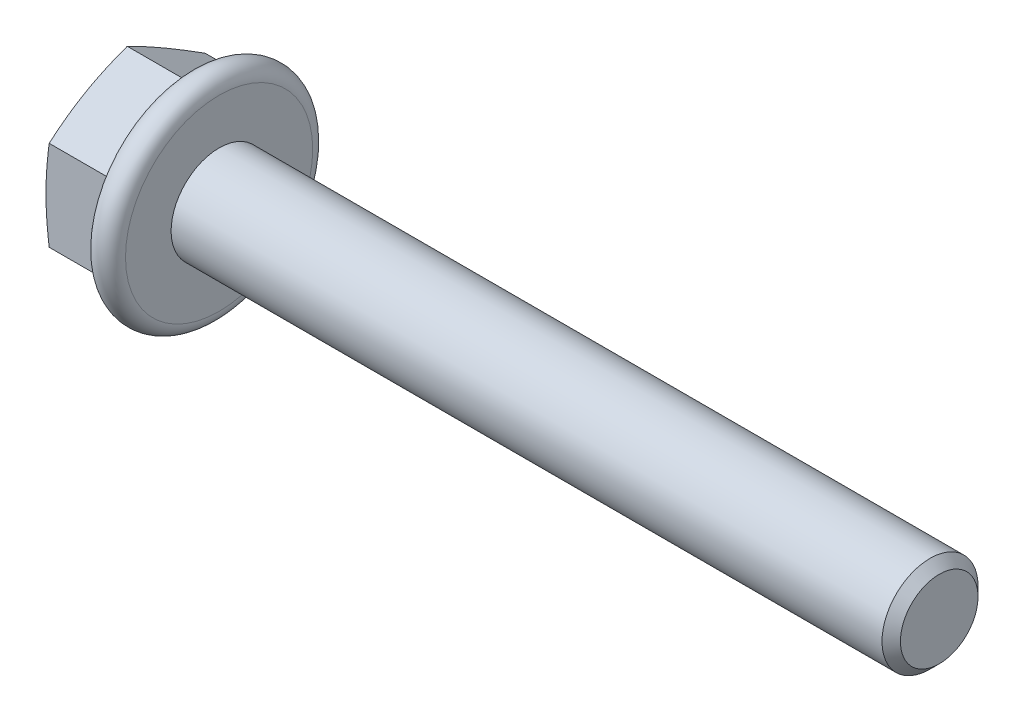
ISO-10303-21;
HEADER;
FILE_DESCRIPTION(('STEP AP214'),'2;1');
FILE_NAME('part.step','',(''),(''),'','','');
FILE_SCHEMA(('AUTOMOTIVE_DESIGN { 1 0 10303 214 1 1 1 1 }'));
ENDSEC;
DATA;
#1=APPLICATION_CONTEXT('core data for automotive mechanical design processes');
#2=APPLICATION_PROTOCOL_DEFINITION('international standard','automotive_design',2000,#1);
#3=PRODUCT_CONTEXT('',#1,'mechanical');
#4=PRODUCT('Part','Part','',(#3));
#5=PRODUCT_RELATED_PRODUCT_CATEGORY('part','',(#4));
#6=PRODUCT_DEFINITION_FORMATION('','',#4);
#7=PRODUCT_DEFINITION_CONTEXT('part definition',#1,'design');
#8=PRODUCT_DEFINITION('design','',#6,#7);
#9=PRODUCT_DEFINITION_SHAPE('','',#8);
#10=(LENGTH_UNIT() NAMED_UNIT(*) SI_UNIT(.MILLI.,.METRE.));
#11=(NAMED_UNIT(*) PLANE_ANGLE_UNIT() SI_UNIT($,.RADIAN.));
#12=(NAMED_UNIT(*) SI_UNIT($,.STERADIAN.) SOLID_ANGLE_UNIT());
#13=UNCERTAINTY_MEASURE_WITH_UNIT(LENGTH_MEASURE(1.E-05),#10,'distance_accuracy_value','');
#14=(GEOMETRIC_REPRESENTATION_CONTEXT(3) GLOBAL_UNCERTAINTY_ASSIGNED_CONTEXT((#13)) GLOBAL_UNIT_ASSIGNED_CONTEXT((#10,
#11,#12)) REPRESENTATION_CONTEXT('',''));
#15=CARTESIAN_POINT('',(0.,0.,0.));
#16=DIRECTION('',(0.,0.,1.));
#17=DIRECTION('',(1.,0.,0.));
#18=AXIS2_PLACEMENT_3D('',#15,#16,#17);
#19=CARTESIAN_POINT('',(0.,5.9,0.));
#20=DIRECTION('',(1.,0.,0.));
#21=DIRECTION('',(0.,1.,0.));
#22=AXIS2_PLACEMENT_3D('',#19,#20,#21);
#23=PLANE('',#22);
#24=CARTESIAN_POINT('',(0.,0.,0.));
#25=DIRECTION('',(1.,0.,0.));
#26=DIRECTION('',(0.,1.,0.));
#27=AXIS2_PLACEMENT_3D('',#24,#25,#26);
#28=CIRCLE('',#27,7.8);
#29=CARTESIAN_POINT('',(0.,7.8,0.));
#30=VERTEX_POINT('',#29);
#31=EDGE_CURVE('E11',#30,#30,#28,.T.);
#32=ORIENTED_EDGE('',*,*,#31,.T.);
#33=EDGE_LOOP('',(#32));
#34=FACE_BOUND('',#33,.T.);
#35=CARTESIAN_POINT('',(0.,0.,0.));
#36=DIRECTION('',(1.,0.,0.));
#37=DIRECTION('',(0.,1.,0.));
#38=AXIS2_PLACEMENT_3D('',#35,#36,#37);
#39=CIRCLE('',#38,4.);
#40=CARTESIAN_POINT('',(0.,4.,0.));
#41=VERTEX_POINT('',#40);
#42=EDGE_CURVE('E242',#41,#41,#39,.T.);
#43=ORIENTED_EDGE('',*,*,#42,.F.);
#44=EDGE_LOOP('',(#43));
#45=FACE_BOUND('',#44,.T.);
#46=ADVANCED_FACE('F16',(#34,#45),#23,.T.);
#47=CARTESIAN_POINT('',(-1.2,0.,0.));
#48=DIRECTION('',(1.,0.,0.));
#49=DIRECTION('',(0.,0.,-1.));
#50=AXIS2_PLACEMENT_3D('',#47,#48,#49);
#51=TOROIDAL_SURFACE('',#50,7.8,1.2);
#52=CARTESIAN_POINT('',(-2.28756934444398,0.,0.));
#53=DIRECTION('',(1.,0.,0.));
#54=DIRECTION('',(0.,1.,0.));
#55=AXIS2_PLACEMENT_3D('',#52,#53,#54);
#56=CIRCLE('',#55,8.30714191408884);
#57=CARTESIAN_POINT('',(-2.28756934444398,8.30714191408884,0.));
#58=VERTEX_POINT('',#57);
#59=EDGE_CURVE('E29',#58,#58,#56,.T.);
#60=ORIENTED_EDGE('',*,*,#59,.T.);
#61=EDGE_LOOP('',(#60));
#62=FACE_BOUND('',#61,.T.);
#63=ORIENTED_EDGE('',*,*,#31,.F.);
#64=EDGE_LOOP('',(#63));
#65=FACE_BOUND('',#64,.T.);
#66=ADVANCED_FACE('F305',(#62,#65),#51,.T.);
#67=CARTESIAN_POINT('',(-2.96628467222199,0.,0.));
#68=DIRECTION('',(1.,0.,0.));
#69=DIRECTION('',(0.,1.,0.));
#70=AXIS2_PLACEMENT_3D('',#67,#68,#69);
#71=CONICAL_SURFACE('',#70,6.85163219661298,1.1344640138);
#72=ORIENTED_EDGE('',*,*,#59,.F.);
#73=EDGE_LOOP('',(#72));
#74=FACE_BOUND('',#73,.T.);
#75=CARTESIAN_POINT('',(-2.66135616087134,3.75277674973256,-6.5));
#76=CARTESIAN_POINT('',(-3.53633042974448,5.62916512459884,-3.25000000000001));
#77=CARTESIAN_POINT('',(-2.66135616087134,7.50555349946513,0.));
#78=(BOUNDED_CURVE() B_SPLINE_CURVE(2,(#75,#76,#77),.UNSPECIFIED.,.F.,
.F.) B_SPLINE_CURVE_WITH_KNOTS((3,3),(0.122119894737377,0.926092360421994),
.UNSPECIFIED.) CURVE() GEOMETRIC_REPRESENTATION_ITEM() RATIONAL_B_SPLINE_CURVE((1.05723361198504,
1.22078822095175,1.05723361198504)) REPRESENTATION_ITEM(''));
#79=CARTESIAN_POINT('',(-2.66135616087134,3.75277674973256,-6.5));
#80=VERTEX_POINT('',#79);
#81=CARTESIAN_POINT('',(-2.66135616087134,7.50555349946513,0.));
#82=VERTEX_POINT('',#81);
#83=EDGE_CURVE('E101',#80,#82,#78,.T.);
#84=ORIENTED_EDGE('',*,*,#83,.T.);
#85=CARTESIAN_POINT('',(-2.66135616087134,7.50555349946513,0.));
#86=CARTESIAN_POINT('',(-3.53633042974448,5.62916512459885,3.24999999999999));
#87=CARTESIAN_POINT('',(-2.66135616087134,3.75277674973257,6.5));
#88=(BOUNDED_CURVE() B_SPLINE_CURVE(2,(#85,#86,#87),.UNSPECIFIED.,.F.,
.F.) B_SPLINE_CURVE_WITH_KNOTS((3,3),(0.122119894737377,0.926092360421993),
.UNSPECIFIED.) CURVE() GEOMETRIC_REPRESENTATION_ITEM() RATIONAL_B_SPLINE_CURVE((1.05723361198504,
1.22078822095176,1.05723361198504)) REPRESENTATION_ITEM(''));
#89=CARTESIAN_POINT('',(-2.66135616087134,3.75277674973257,6.5));
#90=VERTEX_POINT('',#89);
#91=EDGE_CURVE('E172',#82,#90,#88,.T.);
#92=ORIENTED_EDGE('',*,*,#91,.T.);
#93=CARTESIAN_POINT('',(-2.66135616087134,3.75277674973257,6.5));
#94=CARTESIAN_POINT('',(-3.53633042974448,0.,6.5));
#95=CARTESIAN_POINT('',(-2.66135616087134,-3.75277674973257,6.5));
#96=(BOUNDED_CURVE() B_SPLINE_CURVE(2,(#93,#94,#95),.UNSPECIFIED.,.F.,
.F.) B_SPLINE_CURVE_WITH_KNOTS((3,3),(0.122119894737378,0.926092360421994),
.UNSPECIFIED.) CURVE() GEOMETRIC_REPRESENTATION_ITEM() RATIONAL_B_SPLINE_CURVE((1.05723361198504,
1.22078822095175,1.05723361198504)) REPRESENTATION_ITEM(''));
#97=CARTESIAN_POINT('',(-2.66135616087134,-3.75277674973257,6.5));
#98=VERTEX_POINT('',#97);
#99=EDGE_CURVE('E160',#90,#98,#96,.T.);
#100=ORIENTED_EDGE('',*,*,#99,.T.);
#101=CARTESIAN_POINT('',(-2.66135616087134,-3.75277674973257,6.5));
#102=CARTESIAN_POINT('',(-3.53633042974448,-5.62916512459885,3.25000000000001));
#103=CARTESIAN_POINT('',(-2.66135616087134,-7.50555349946514,0.));
#104=(BOUNDED_CURVE() B_SPLINE_CURVE(2,(#101,#102,#103),.UNSPECIFIED.,.F.,
.F.) B_SPLINE_CURVE_WITH_KNOTS((3,3),(0.122119894737378,0.926092360421993),
.UNSPECIFIED.) CURVE() GEOMETRIC_REPRESENTATION_ITEM() RATIONAL_B_SPLINE_CURVE((1.05723361198504,
1.22078822095175,1.05723361198504)) REPRESENTATION_ITEM(''));
#105=CARTESIAN_POINT('',(-2.66135616087133,-7.50555349946514,0.));
#106=VERTEX_POINT('',#105);
#107=EDGE_CURVE('E186',#98,#106,#104,.T.);
#108=ORIENTED_EDGE('',*,*,#107,.T.);
#109=CARTESIAN_POINT('',(-2.66135616087133,-7.50555349946514,0.));
#110=CARTESIAN_POINT('',(-3.53633042974447,-5.62916512459886,-3.24999999999999));
#111=CARTESIAN_POINT('',(-2.66135616087134,-3.75277674973257,-6.5));
#112=(BOUNDED_CURVE() B_SPLINE_CURVE(2,(#109,#110,#111),.UNSPECIFIED.,.F.,
.F.) B_SPLINE_CURVE_WITH_KNOTS((3,3),(0.122119894737377,0.926092360421993),
.UNSPECIFIED.) CURVE() GEOMETRIC_REPRESENTATION_ITEM() RATIONAL_B_SPLINE_CURVE((1.05723361198504,
1.22078822095175,1.05723361198504)) REPRESENTATION_ITEM(''));
#113=CARTESIAN_POINT('',(-2.66135616087134,-3.75277674973257,-6.5));
#114=VERTEX_POINT('',#113);
#115=EDGE_CURVE('E118',#106,#114,#112,.T.);
#116=ORIENTED_EDGE('',*,*,#115,.T.);
#117=CARTESIAN_POINT('',(-2.66135616087134,-3.75277674973257,-6.5));
#118=CARTESIAN_POINT('',(-3.53633042974447,0.,-6.5));
#119=CARTESIAN_POINT('',(-2.66135616087134,3.75277674973256,-6.5));
#120=(BOUNDED_CURVE() B_SPLINE_CURVE(2,(#117,#118,#119),.UNSPECIFIED.,.F.,
.F.) B_SPLINE_CURVE_WITH_KNOTS((3,3),(0.122119894737377,0.926092360421993),
.UNSPECIFIED.) CURVE() GEOMETRIC_REPRESENTATION_ITEM() RATIONAL_B_SPLINE_CURVE((1.05723361198504,
1.22078822095175,1.05723361198504)) REPRESENTATION_ITEM(''));
#121=EDGE_CURVE('E115',#114,#80,#120,.T.);
#122=ORIENTED_EDGE('',*,*,#121,.T.);
#123=EDGE_LOOP('',(#84,#92,#100,#108,#116,#122));
#124=FACE_BOUND('',#123,.T.);
#125=ADVANCED_FACE('F116',(#74,#124),#71,.T.);
#126=CARTESIAN_POINT('',(-8.1,0.,0.));
#127=DIRECTION('',(1.,0.,0.));
#128=DIRECTION('',(0.,1.,0.));
#129=AXIS2_PLACEMENT_3D('',#126,#127,#128);
#130=PLANE('',#129);
#131=CARTESIAN_POINT('',(-8.1,0.,0.));
#132=DIRECTION('',(-1.,0.,0.));
#133=DIRECTION('',(0.,1.,0.));
#134=AXIS2_PLACEMENT_3D('',#131,#132,#133);
#135=CIRCLE('',#134,5.85);
#136=CARTESIAN_POINT('',(-8.1,5.85,0.));
#137=VERTEX_POINT('',#136);
#138=EDGE_CURVE('E94',#137,#137,#135,.T.);
#139=ORIENTED_EDGE('',*,*,#138,.T.);
#140=EDGE_LOOP('',(#139));
#141=FACE_BOUND('',#140,.T.);
#142=ADVANCED_FACE('F18',(#141),#130,.F.);
#143=CARTESIAN_POINT('',(0.,-7.50555349946514,0.));
#144=DIRECTION('',(0.,-0.866025403784439,-0.5));
#145=DIRECTION('',(0.,0.5,-0.866025403784439));
#146=AXIS2_PLACEMENT_3D('',#143,#144,#145);
#147=PLANE('',#146);
#148=CARTESIAN_POINT('',(-7.6563957767918,-7.50555349946513,0.));
#149=CARTESIAN_POINT('',(-8.15917252652436,-5.62916512459886,-3.25));
#150=CARTESIAN_POINT('',(-7.6563957767918,-3.75277674973258,-6.5));
#151=(BOUNDED_CURVE() B_SPLINE_CURVE(2,(#148,#149,#150),.UNSPECIFIED.,.F.,
.F.) B_SPLINE_CURVE_WITH_KNOTS((3,3),(0.,0.75248733581402),
.UNSPECIFIED.) CURVE() GEOMETRIC_REPRESENTATION_ITEM() RATIONAL_B_SPLINE_CURVE((1.,
1.15470053837925,1.)) REPRESENTATION_ITEM(''));
#152=CARTESIAN_POINT('',(-7.6563957767918,-7.50555349946513,0.));
#153=VERTEX_POINT('',#152);
#154=CARTESIAN_POINT('',(-7.6563957767918,-3.75277674973258,-6.5));
#155=VERTEX_POINT('',#154);
#156=EDGE_CURVE('E175',#153,#155,#151,.T.);
#157=ORIENTED_EDGE('',*,*,#156,.T.);
#158=DIRECTION('',(-1.,0.,0.));
#159=VECTOR('',#158,1.);
#160=CARTESIAN_POINT('',(0.,-3.75277674973257,-6.5));
#161=LINE('',#160,#159);
#162=EDGE_CURVE('E123',#114,#155,#161,.T.);
#163=ORIENTED_EDGE('',*,*,#162,.F.);
#164=ORIENTED_EDGE('',*,*,#115,.F.);
#165=DIRECTION('',(-1.,0.,0.));
#166=VECTOR('',#165,1.);
#167=CARTESIAN_POINT('',(0.,-7.50555349946514,0.));
#168=LINE('',#167,#166);
#169=EDGE_CURVE('E139',#106,#153,#168,.T.);
#170=ORIENTED_EDGE('',*,*,#169,.T.);
#171=EDGE_LOOP('',(#157,#163,#164,#170));
#172=FACE_BOUND('',#171,.T.);
#173=ADVANCED_FACE('F291',(#172),#147,.T.);
#174=CARTESIAN_POINT('',(0.,-3.75277674973257,6.5));
#175=DIRECTION('',(0.,-0.866025403784438,0.5));
#176=DIRECTION('',(-1.,0.,0.));
#177=AXIS2_PLACEMENT_3D('',#174,#175,#176);
#178=PLANE('',#177);
#179=CARTESIAN_POINT('',(-7.6563957767918,-3.75277674973257,6.5));
#180=CARTESIAN_POINT('',(-8.15917252652436,-5.62916512459886,3.25));
#181=CARTESIAN_POINT('',(-7.6563957767918,-7.50555349946513,0.));
#182=(BOUNDED_CURVE() B_SPLINE_CURVE(2,(#179,#180,#181),.UNSPECIFIED.,.F.,
.F.) B_SPLINE_CURVE_WITH_KNOTS((3,3),(0.,0.75248733581402),
.UNSPECIFIED.) CURVE() GEOMETRIC_REPRESENTATION_ITEM() RATIONAL_B_SPLINE_CURVE((1.,
1.15470053837925,1.)) REPRESENTATION_ITEM(''));
#183=CARTESIAN_POINT('',(-7.6563957767918,-3.75277674973256,6.5));
#184=VERTEX_POINT('',#183);
#185=EDGE_CURVE('E135',#184,#153,#182,.T.);
#186=ORIENTED_EDGE('',*,*,#185,.T.);
#187=ORIENTED_EDGE('',*,*,#169,.F.);
#188=ORIENTED_EDGE('',*,*,#107,.F.);
#189=DIRECTION('',(-1.,0.,0.));
#190=VECTOR('',#189,1.);
#191=CARTESIAN_POINT('',(0.,-3.75277674973257,6.5));
#192=LINE('',#191,#190);
#193=EDGE_CURVE('E166',#98,#184,#192,.T.);
#194=ORIENTED_EDGE('',*,*,#193,.T.);
#195=EDGE_LOOP('',(#186,#187,#188,#194));
#196=FACE_BOUND('',#195,.T.);
#197=ADVANCED_FACE('F285',(#196),#178,.T.);
#198=CARTESIAN_POINT('',(0.,3.75277674973257,6.5));
#199=DIRECTION('',(0.,0.,1.));
#200=DIRECTION('',(0.,-1.,0.));
#201=AXIS2_PLACEMENT_3D('',#198,#199,#200);
#202=PLANE('',#201);
#203=CARTESIAN_POINT('',(-7.6563957767918,3.75277674973257,6.5));
#204=CARTESIAN_POINT('',(-8.15917252652437,0.,6.50000000000001));
#205=CARTESIAN_POINT('',(-7.6563957767918,-3.75277674973257,6.5));
#206=(BOUNDED_CURVE() B_SPLINE_CURVE(2,(#203,#204,#205),.UNSPECIFIED.,.F.,
.F.) B_SPLINE_CURVE_WITH_KNOTS((3,3),(0.,0.752487335814022),
.UNSPECIFIED.) CURVE() GEOMETRIC_REPRESENTATION_ITEM() RATIONAL_B_SPLINE_CURVE((1.,
1.15470053837925,1.)) REPRESENTATION_ITEM(''));
#207=CARTESIAN_POINT('',(-7.6563957767918,3.75277674973256,6.5));
#208=VERTEX_POINT('',#207);
#209=EDGE_CURVE('E20',#208,#184,#206,.T.);
#210=ORIENTED_EDGE('',*,*,#209,.T.);
#211=ORIENTED_EDGE('',*,*,#193,.F.);
#212=ORIENTED_EDGE('',*,*,#99,.F.);
#213=DIRECTION('',(-1.,0.,0.));
#214=VECTOR('',#213,1.);
#215=CARTESIAN_POINT('',(0.,3.75277674973257,6.5));
#216=LINE('',#215,#214);
#217=EDGE_CURVE('E112',#90,#208,#216,.T.);
#218=ORIENTED_EDGE('',*,*,#217,.T.);
#219=EDGE_LOOP('',(#210,#211,#212,#218));
#220=FACE_BOUND('',#219,.T.);
#221=ADVANCED_FACE('F320',(#220),#202,.T.);
#222=CARTESIAN_POINT('',(0.,7.50555349946513,0.));
#223=DIRECTION('',(0.,0.866025403784439,0.5));
#224=DIRECTION('',(1.,0.,0.));
#225=AXIS2_PLACEMENT_3D('',#222,#223,#224);
#226=PLANE('',#225);
#227=CARTESIAN_POINT('',(-7.6563957767918,7.50555349946513,0.));
#228=CARTESIAN_POINT('',(-8.15917252652436,5.62916512459886,3.25));
#229=CARTESIAN_POINT('',(-7.6563957767918,3.75277674973257,6.5));
#230=(BOUNDED_CURVE() B_SPLINE_CURVE(2,(#227,#228,#229),.UNSPECIFIED.,.F.,
.F.) B_SPLINE_CURVE_WITH_KNOTS((3,3),(0.,0.75248733581402),
.UNSPECIFIED.) CURVE() GEOMETRIC_REPRESENTATION_ITEM() RATIONAL_B_SPLINE_CURVE((1.,
1.15470053837925,1.)) REPRESENTATION_ITEM(''));
#231=CARTESIAN_POINT('',(-7.6563957767918,7.50555349946513,0.));
#232=VERTEX_POINT('',#231);
#233=EDGE_CURVE('E143',#232,#208,#230,.T.);
#234=ORIENTED_EDGE('',*,*,#233,.T.);
#235=ORIENTED_EDGE('',*,*,#217,.F.);
#236=ORIENTED_EDGE('',*,*,#91,.F.);
#237=DIRECTION('',(-1.,0.,0.));
#238=VECTOR('',#237,1.);
#239=CARTESIAN_POINT('',(0.,7.50555349946513,0.));
#240=LINE('',#239,#238);
#241=EDGE_CURVE('E108',#82,#232,#240,.T.);
#242=ORIENTED_EDGE('',*,*,#241,.T.);
#243=EDGE_LOOP('',(#234,#235,#236,#242));
#244=FACE_BOUND('',#243,.T.);
#245=ADVANCED_FACE('F317',(#244),#226,.T.);
#246=CARTESIAN_POINT('',(0.,3.75277674973256,-6.5));
#247=DIRECTION('',(0.,0.866025403784439,-0.5));
#248=DIRECTION('',(-1.,0.,0.));
#249=AXIS2_PLACEMENT_3D('',#246,#247,#248);
#250=PLANE('',#249);
#251=CARTESIAN_POINT('',(-7.6563957767918,3.75277674973256,-6.5));
#252=CARTESIAN_POINT('',(-8.15917252652437,5.62916512459886,-3.25));
#253=CARTESIAN_POINT('',(-7.6563957767918,7.50555349946513,0.));
#254=(BOUNDED_CURVE() B_SPLINE_CURVE(2,(#251,#252,#253),.UNSPECIFIED.,.F.,
.F.) B_SPLINE_CURVE_WITH_KNOTS((3,3),(0.,0.752487335814022),
.UNSPECIFIED.) CURVE() GEOMETRIC_REPRESENTATION_ITEM() RATIONAL_B_SPLINE_CURVE((1.,
1.15470053837925,1.)) REPRESENTATION_ITEM(''));
#255=CARTESIAN_POINT('',(-7.6563957767918,3.75277674973256,-6.5));
#256=VERTEX_POINT('',#255);
#257=EDGE_CURVE('E149',#256,#232,#254,.T.);
#258=ORIENTED_EDGE('',*,*,#257,.T.);
#259=ORIENTED_EDGE('',*,*,#241,.F.);
#260=ORIENTED_EDGE('',*,*,#83,.F.);
#261=DIRECTION('',(-1.,0.,0.));
#262=VECTOR('',#261,1.);
#263=CARTESIAN_POINT('',(0.,3.75277674973256,-6.5));
#264=LINE('',#263,#262);
#265=EDGE_CURVE('E106',#80,#256,#264,.T.);
#266=ORIENTED_EDGE('',*,*,#265,.T.);
#267=EDGE_LOOP('',(#258,#259,#260,#266));
#268=FACE_BOUND('',#267,.T.);
#269=ADVANCED_FACE('F104',(#268),#250,.T.);
#270=CARTESIAN_POINT('',(0.,-3.75277674973257,-6.5));
#271=DIRECTION('',(0.,0.,-1.));
#272=DIRECTION('',(0.,-1.,0.));
#273=AXIS2_PLACEMENT_3D('',#270,#271,#272);
#274=PLANE('',#273);
#275=CARTESIAN_POINT('',(-7.6563957767918,-3.75277674973256,-6.5));
#276=CARTESIAN_POINT('',(-8.15917252652436,0.,-6.50000000000001));
#277=CARTESIAN_POINT('',(-7.6563957767918,3.75277674973256,-6.5));
#278=(BOUNDED_CURVE() B_SPLINE_CURVE(2,(#275,#276,#277),.UNSPECIFIED.,.F.,
.F.) B_SPLINE_CURVE_WITH_KNOTS((3,3),(0.,0.75248733581402),
.UNSPECIFIED.) CURVE() GEOMETRIC_REPRESENTATION_ITEM() RATIONAL_B_SPLINE_CURVE((1.,
1.15470053837925,1.)) REPRESENTATION_ITEM(''));
#279=EDGE_CURVE('E127',#155,#256,#278,.T.);
#280=ORIENTED_EDGE('',*,*,#279,.T.);
#281=ORIENTED_EDGE('',*,*,#265,.F.);
#282=ORIENTED_EDGE('',*,*,#121,.F.);
#283=ORIENTED_EDGE('',*,*,#162,.T.);
#284=EDGE_LOOP('',(#280,#281,#282,#283));
#285=FACE_BOUND('',#284,.T.);
#286=ADVANCED_FACE('F125',(#285),#274,.T.);
#287=CARTESIAN_POINT('',(-7.8781978883959,0.,0.));
#288=DIRECTION('',(1.,0.,0.));
#289=DIRECTION('',(0.,1.,0.));
#290=AXIS2_PLACEMENT_3D('',#287,#288,#289);
#291=CONICAL_SURFACE('',#290,6.67777674973256,1.308996939);
#292=ORIENTED_EDGE('',*,*,#138,.F.);
#293=EDGE_LOOP('',(#292));
#294=FACE_BOUND('',#293,.T.);
#295=ORIENTED_EDGE('',*,*,#209,.F.);
#296=ORIENTED_EDGE('',*,*,#233,.F.);
#297=ORIENTED_EDGE('',*,*,#257,.F.);
#298=ORIENTED_EDGE('',*,*,#279,.F.);
#299=ORIENTED_EDGE('',*,*,#156,.F.);
#300=ORIENTED_EDGE('',*,*,#185,.F.);
#301=EDGE_LOOP('',(#295,#296,#297,#298,#299,#300));
#302=FACE_BOUND('',#301,.T.);
#303=ADVANCED_FACE('F289',(#294,#302),#291,.T.);
#304=CARTESIAN_POINT('',(60.,2.,0.));
#305=DIRECTION('',(1.,0.,0.));
#306=DIRECTION('',(0.,1.,0.));
#307=AXIS2_PLACEMENT_3D('',#304,#305,#306);
#308=PLANE('',#307);
#309=CARTESIAN_POINT('',(60.,0.,0.));
#310=DIRECTION('',(-1.,0.,0.));
#311=DIRECTION('',(0.,-1.,0.));
#312=AXIS2_PLACEMENT_3D('',#309,#310,#311);
#313=CIRCLE('',#312,3.23318750000001);
#314=CARTESIAN_POINT('',(60.,3.23318750000001,0.));
#315=VERTEX_POINT('',#314);
#316=EDGE_CURVE('E249',#315,#315,#313,.T.);
#317=ORIENTED_EDGE('',*,*,#316,.F.);
#318=EDGE_LOOP('',(#317));
#319=FACE_BOUND('',#318,.T.);
#320=ADVANCED_FACE('F348',(#319),#308,.T.);
#321=CARTESIAN_POINT('',(49.,0.,0.));
#322=DIRECTION('',(1.,0.,0.));
#323=DIRECTION('',(0.,1.,0.));
#324=AXIS2_PLACEMENT_3D('',#321,#322,#323);
#325=CYLINDRICAL_SURFACE('',#324,4.);
#326=CARTESIAN_POINT('',(59.2331875000001,0.,0.));
#327=DIRECTION('',(1.,0.,0.));
#328=DIRECTION('',(0.,-1.,0.));
#329=AXIS2_PLACEMENT_3D('',#326,#327,#328);
#330=CIRCLE('',#329,4.);
#331=CARTESIAN_POINT('',(59.2331875,4.,0.));
#332=VERTEX_POINT('',#331);
#333=EDGE_CURVE('E257',#332,#332,#330,.T.);
#334=ORIENTED_EDGE('',*,*,#333,.F.);
#335=EDGE_LOOP('',(#334));
#336=FACE_BOUND('',#335,.T.);
#337=ORIENTED_EDGE('',*,*,#42,.T.);
#338=EDGE_LOOP('',(#337));
#339=FACE_BOUND('',#338,.T.);
#340=ADVANCED_FACE('F302',(#336,#339),#325,.T.);
#341=CARTESIAN_POINT('',(59.61659375,0.,0.));
#342=DIRECTION('',(-1.,0.,0.));
#343=DIRECTION('',(0.,-1.,0.));
#344=AXIS2_PLACEMENT_3D('',#341,#342,#343);
#345=CONICAL_SURFACE('',#344,3.61659375,0.785398163400002);
#346=ORIENTED_EDGE('',*,*,#316,.T.);
#347=EDGE_LOOP('',(#346));
#348=FACE_BOUND('',#347,.T.);
#349=ORIENTED_EDGE('',*,*,#333,.T.);
#350=EDGE_LOOP('',(#349));
#351=FACE_BOUND('',#350,.T.);
#352=ADVANCED_FACE('F364',(#348,#351),#345,.T.);
#353=CLOSED_SHELL('',(#46,#66,#125,#142,#173,#197,#221,#245,#269,#286,#303,#320,#340,#352));
#354=MANIFOLD_SOLID_BREP('B1',#353);
#355=ADVANCED_BREP_SHAPE_REPRESENTATION('',(#18,#354),#14);
#356=SHAPE_DEFINITION_REPRESENTATION(#9,#355);
ENDSEC;
END-ISO-10303-21;
